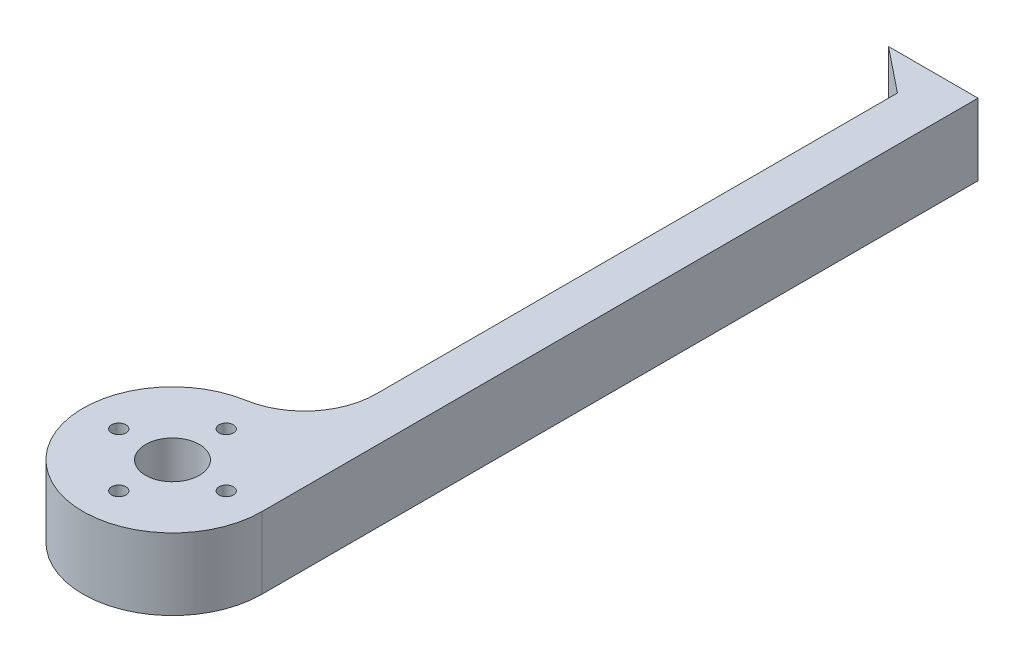
ISO-10303-21;
HEADER;
FILE_DESCRIPTION(('STEP AP214'),'2;1');
FILE_NAME('part.step','',(''),(''),'','','');
FILE_SCHEMA(('AUTOMOTIVE_DESIGN { 1 0 10303 214 1 1 1 1 }'));
ENDSEC;
DATA;
#1=APPLICATION_CONTEXT('core data for automotive mechanical design processes');
#2=APPLICATION_PROTOCOL_DEFINITION('international standard','automotive_design',2000,#1);
#3=PRODUCT_CONTEXT('',#1,'mechanical');
#4=PRODUCT('Part','Part','',(#3));
#5=PRODUCT_RELATED_PRODUCT_CATEGORY('part','',(#4));
#6=PRODUCT_DEFINITION_FORMATION('','',#4);
#7=PRODUCT_DEFINITION_CONTEXT('part definition',#1,'design');
#8=PRODUCT_DEFINITION('design','',#6,#7);
#9=PRODUCT_DEFINITION_SHAPE('','',#8);
#10=(LENGTH_UNIT() NAMED_UNIT(*) SI_UNIT(.MILLI.,.METRE.));
#11=(NAMED_UNIT(*) PLANE_ANGLE_UNIT() SI_UNIT($,.RADIAN.));
#12=(NAMED_UNIT(*) SI_UNIT($,.STERADIAN.) SOLID_ANGLE_UNIT());
#13=UNCERTAINTY_MEASURE_WITH_UNIT(LENGTH_MEASURE(1.E-05),#10,'distance_accuracy_value','');
#14=(GEOMETRIC_REPRESENTATION_CONTEXT(3) GLOBAL_UNCERTAINTY_ASSIGNED_CONTEXT((#13)) GLOBAL_UNIT_ASSIGNED_CONTEXT((#10,
#11,#12)) REPRESENTATION_CONTEXT('',''));
#15=CARTESIAN_POINT('',(0.,0.,0.));
#16=DIRECTION('',(0.,0.,1.));
#17=DIRECTION('',(1.,0.,0.));
#18=AXIS2_PLACEMENT_3D('',#15,#16,#17);
#19=CARTESIAN_POINT('',(0.,10.,0.));
#20=DIRECTION('',(0.,-1.,0.));
#21=DIRECTION('',(0.,0.,-1.));
#22=AXIS2_PLACEMENT_3D('',#19,#20,#21);
#23=CYLINDRICAL_SURFACE('',#22,12.5);
#24=CARTESIAN_POINT('',(0.,10.,0.));
#25=DIRECTION('',(0.,1.,0.));
#26=DIRECTION('',(0.,0.,1.));
#27=AXIS2_PLACEMENT_3D('',#24,#25,#26);
#28=CIRCLE('',#27,12.5);
#29=CARTESIAN_POINT('',(-2.08333333333334,10.,-12.3251662147909));
#30=VERTEX_POINT('',#29);
#31=CARTESIAN_POINT('',(12.5,10.,0.));
#32=VERTEX_POINT('',#31);
#33=EDGE_CURVE('E88',#30,#32,#28,.T.);
#34=ORIENTED_EDGE('',*,*,#33,.F.);
#35=DIRECTION('',(0.,-1.,0.));
#36=VECTOR('',#35,1.);
#37=CARTESIAN_POINT('',(-2.08333333333334,10.,-12.3251662147909));
#38=LINE('',#37,#36);
#39=CARTESIAN_POINT('',(-2.08333333333334,0.,-12.3251662147909));
#40=VERTEX_POINT('',#39);
#41=EDGE_CURVE('E108',#30,#40,#38,.T.);
#42=ORIENTED_EDGE('',*,*,#41,.T.);
#43=CARTESIAN_POINT('',(0.,0.,0.));
#44=DIRECTION('',(0.,1.,0.));
#45=DIRECTION('',(0.,0.,1.));
#46=AXIS2_PLACEMENT_3D('',#43,#44,#45);
#47=CIRCLE('',#46,12.5);
#48=CARTESIAN_POINT('',(12.5,0.,0.));
#49=VERTEX_POINT('',#48);
#50=EDGE_CURVE('E104',#40,#49,#47,.T.);
#51=ORIENTED_EDGE('',*,*,#50,.T.);
#52=DIRECTION('',(0.,-1.,0.));
#53=VECTOR('',#52,1.);
#54=CARTESIAN_POINT('',(12.5,10.,0.));
#55=LINE('',#54,#53);
#56=EDGE_CURVE('E103',#32,#49,#55,.T.);
#57=ORIENTED_EDGE('',*,*,#56,.F.);
#58=EDGE_LOOP('',(#34,#42,#51,#57));
#59=FACE_BOUND('',#58,.T.);
#60=ADVANCED_FACE('F35',(#59),#23,.T.);
#61=CARTESIAN_POINT('',(12.5,10.,0.));
#62=DIRECTION('',(1.,0.,0.));
#63=DIRECTION('',(0.,0.,-1.));
#64=AXIS2_PLACEMENT_3D('',#61,#62,#63);
#65=PLANE('',#64);
#66=DIRECTION('',(0.,0.,1.));
#67=VECTOR('',#66,1.);
#68=CARTESIAN_POINT('',(12.5,0.,0.));
#69=LINE('',#68,#67);
#70=CARTESIAN_POINT('',(12.5,0.,-100.));
#71=VERTEX_POINT('',#70);
#72=EDGE_CURVE('E139',#71,#49,#69,.T.);
#73=ORIENTED_EDGE('',*,*,#72,.F.);
#74=DIRECTION('',(0.,-1.,0.));
#75=VECTOR('',#74,1.);
#76=CARTESIAN_POINT('',(12.5,10.,-100.));
#77=LINE('',#76,#75);
#78=CARTESIAN_POINT('',(12.5,10.,-100.));
#79=VERTEX_POINT('',#78);
#80=EDGE_CURVE('E109',#79,#71,#77,.T.);
#81=ORIENTED_EDGE('',*,*,#80,.F.);
#82=DIRECTION('',(0.,0.,1.));
#83=VECTOR('',#82,1.);
#84=CARTESIAN_POINT('',(12.5,10.,0.));
#85=LINE('',#84,#83);
#86=EDGE_CURVE('E94',#79,#32,#85,.T.);
#87=ORIENTED_EDGE('',*,*,#86,.T.);
#88=ORIENTED_EDGE('',*,*,#56,.T.);
#89=EDGE_LOOP('',(#73,#81,#87,#88));
#90=FACE_BOUND('',#89,.T.);
#91=ADVANCED_FACE('F111',(#90),#65,.T.);
#92=CARTESIAN_POINT('',(0.,10.,-100.));
#93=DIRECTION('',(0.,0.,-1.));
#94=DIRECTION('',(-1.,0.,0.));
#95=AXIS2_PLACEMENT_3D('',#92,#93,#94);
#96=PLANE('',#95);
#97=DIRECTION('',(1.,0.,0.));
#98=VECTOR('',#97,1.);
#99=CARTESIAN_POINT('',(0.,0.,-100.));
#100=LINE('',#99,#98);
#101=CARTESIAN_POINT('',(0.,0.,-100.));
#102=VERTEX_POINT('',#101);
#103=EDGE_CURVE('E141',#102,#71,#100,.T.);
#104=ORIENTED_EDGE('',*,*,#103,.F.);
#105=DIRECTION('',(0.,-1.,0.));
#106=VECTOR('',#105,1.);
#107=CARTESIAN_POINT('',(0.,10.,-100.));
#108=LINE('',#107,#106);
#109=CARTESIAN_POINT('',(0.,10.,-100.));
#110=VERTEX_POINT('',#109);
#111=EDGE_CURVE('E160',#110,#102,#108,.T.);
#112=ORIENTED_EDGE('',*,*,#111,.F.);
#113=DIRECTION('',(1.,0.,0.));
#114=VECTOR('',#113,1.);
#115=CARTESIAN_POINT('',(0.,10.,-100.));
#116=LINE('',#115,#114);
#117=EDGE_CURVE('E112',#110,#79,#116,.T.);
#118=ORIENTED_EDGE('',*,*,#117,.T.);
#119=ORIENTED_EDGE('',*,*,#80,.T.);
#120=EDGE_LOOP('',(#104,#112,#118,#119));
#121=FACE_BOUND('',#120,.T.);
#122=ADVANCED_FACE('F170',(#121),#96,.T.);
#123=CARTESIAN_POINT('',(48.7804878048781,10.,-60.9756097560974));
#124=DIRECTION('',(-0.624695047554425,0.,0.780868809443029));
#125=DIRECTION('',(0.780868809443029,0.,0.624695047554425));
#126=AXIS2_PLACEMENT_3D('',#123,#124,#125);
#127=PLANE('',#126);
#128=DIRECTION('',(-0.780868809443029,0.,-0.624695047554425));
#129=VECTOR('',#128,1.);
#130=CARTESIAN_POINT('',(48.7804878048781,0.,-60.9756097560974));
#131=LINE('',#130,#129);
#132=CARTESIAN_POINT('',(6.24999999999998,0.,-95.));
#133=VERTEX_POINT('',#132);
#134=EDGE_CURVE('E144',#133,#102,#131,.T.);
#135=ORIENTED_EDGE('',*,*,#134,.F.);
#136=DIRECTION('',(0.,-1.,0.));
#137=VECTOR('',#136,1.);
#138=CARTESIAN_POINT('',(6.24999999999998,10.,-95.));
#139=LINE('',#138,#137);
#140=CARTESIAN_POINT('',(6.24999999999998,10.,-95.));
#141=VERTEX_POINT('',#140);
#142=EDGE_CURVE('E131',#141,#133,#139,.T.);
#143=ORIENTED_EDGE('',*,*,#142,.F.);
#144=DIRECTION('',(-0.780868809443029,0.,-0.624695047554425));
#145=VECTOR('',#144,1.);
#146=CARTESIAN_POINT('',(48.7804878048781,10.,-60.9756097560974));
#147=LINE('',#146,#145);
#148=EDGE_CURVE('E114',#141,#110,#147,.T.);
#149=ORIENTED_EDGE('',*,*,#148,.T.);
#150=ORIENTED_EDGE('',*,*,#111,.T.);
#151=EDGE_LOOP('',(#135,#143,#149,#150));
#152=FACE_BOUND('',#151,.T.);
#153=ADVANCED_FACE('F173',(#152),#127,.T.);
#154=CARTESIAN_POINT('',(-7.5,10.,0.));
#155=DIRECTION('',(0.,-1.,0.));
#156=DIRECTION('',(0.,0.,-1.));
#157=AXIS2_PLACEMENT_3D('',#154,#155,#156);
#158=CYLINDRICAL_SURFACE('',#157,1.);
#159=CARTESIAN_POINT('',(-7.5,10.,0.));
#160=DIRECTION('',(0.,1.,0.));
#161=DIRECTION('',(0.,0.,1.));
#162=AXIS2_PLACEMENT_3D('',#159,#160,#161);
#163=CIRCLE('',#162,1.);
#164=CARTESIAN_POINT('',(-7.5,10.,0.99999999999991));
#165=VERTEX_POINT('',#164);
#166=EDGE_CURVE('E125',#165,#165,#163,.T.);
#167=ORIENTED_EDGE('',*,*,#166,.T.);
#168=EDGE_LOOP('',(#167));
#169=FACE_BOUND('',#168,.T.);
#170=CARTESIAN_POINT('',(-7.5,0.,0.));
#171=DIRECTION('',(0.,1.,0.));
#172=DIRECTION('',(0.,0.,1.));
#173=AXIS2_PLACEMENT_3D('',#170,#171,#172);
#174=CIRCLE('',#173,1.);
#175=CARTESIAN_POINT('',(-7.5,0.,0.99999999999991));
#176=VERTEX_POINT('',#175);
#177=EDGE_CURVE('E152',#176,#176,#174,.T.);
#178=ORIENTED_EDGE('',*,*,#177,.F.);
#179=EDGE_LOOP('',(#178));
#180=FACE_BOUND('',#179,.T.);
#181=ADVANCED_FACE('F218',(#169,#180),#158,.F.);
#182=CARTESIAN_POINT('',(7.5,10.,0.));
#183=DIRECTION('',(0.,-1.,0.));
#184=DIRECTION('',(0.,0.,-1.));
#185=AXIS2_PLACEMENT_3D('',#182,#183,#184);
#186=CYLINDRICAL_SURFACE('',#185,1.);
#187=CARTESIAN_POINT('',(7.5,10.,0.));
#188=DIRECTION('',(0.,1.,0.));
#189=DIRECTION('',(0.,0.,1.));
#190=AXIS2_PLACEMENT_3D('',#187,#188,#189);
#191=CIRCLE('',#190,1.);
#192=CARTESIAN_POINT('',(7.5,10.,1.00000000000004));
#193=VERTEX_POINT('',#192);
#194=EDGE_CURVE('E122',#193,#193,#191,.T.);
#195=ORIENTED_EDGE('',*,*,#194,.T.);
#196=EDGE_LOOP('',(#195));
#197=FACE_BOUND('',#196,.T.);
#198=CARTESIAN_POINT('',(7.5,0.,0.));
#199=DIRECTION('',(0.,1.,0.));
#200=DIRECTION('',(0.,0.,1.));
#201=AXIS2_PLACEMENT_3D('',#198,#199,#200);
#202=CIRCLE('',#201,1.);
#203=CARTESIAN_POINT('',(7.5,0.,1.00000000000004));
#204=VERTEX_POINT('',#203);
#205=EDGE_CURVE('E149',#204,#204,#202,.T.);
#206=ORIENTED_EDGE('',*,*,#205,.F.);
#207=EDGE_LOOP('',(#206));
#208=FACE_BOUND('',#207,.T.);
#209=ADVANCED_FACE('F221',(#197,#208),#186,.F.);
#210=CARTESIAN_POINT('',(6.25,10.,0.));
#211=DIRECTION('',(1.,0.,0.));
#212=DIRECTION('',(0.,0.,-1.));
#213=AXIS2_PLACEMENT_3D('',#210,#211,#212);
#214=PLANE('',#213);
#215=DIRECTION('',(0.,0.,1.));
#216=VECTOR('',#215,1.);
#217=CARTESIAN_POINT('',(6.25,0.,0.));
#218=LINE('',#217,#216);
#219=CARTESIAN_POINT('',(6.25,0.,-22.1852991866236));
#220=VERTEX_POINT('',#219);
#221=EDGE_CURVE('E147',#133,#220,#218,.T.);
#222=ORIENTED_EDGE('',*,*,#221,.T.);
#223=DIRECTION('',(0.,1.,0.));
#224=VECTOR('',#223,1.);
#225=CARTESIAN_POINT('',(6.25,10.,-22.1852991866236));
#226=LINE('',#225,#224);
#227=CARTESIAN_POINT('',(6.25,10.,-22.1852991866236));
#228=VERTEX_POINT('',#227);
#229=EDGE_CURVE('E50',#220,#228,#226,.T.);
#230=ORIENTED_EDGE('',*,*,#229,.T.);
#231=DIRECTION('',(0.,0.,1.));
#232=VECTOR('',#231,1.);
#233=CARTESIAN_POINT('',(6.25,10.,0.));
#234=LINE('',#233,#232);
#235=EDGE_CURVE('E120',#141,#228,#234,.T.);
#236=ORIENTED_EDGE('',*,*,#235,.F.);
#237=ORIENTED_EDGE('',*,*,#142,.T.);
#238=EDGE_LOOP('',(#222,#230,#236,#237));
#239=FACE_BOUND('',#238,.T.);
#240=ADVANCED_FACE('F174',(#239),#214,.F.);
#241=CARTESIAN_POINT('',(0.,10.,-7.5));
#242=DIRECTION('',(0.,-1.,0.));
#243=DIRECTION('',(0.,0.,-1.));
#244=AXIS2_PLACEMENT_3D('',#241,#242,#243);
#245=CYLINDRICAL_SURFACE('',#244,1.);
#246=CARTESIAN_POINT('',(0.,10.,-7.5));
#247=DIRECTION('',(0.,1.,0.));
#248=DIRECTION('',(0.,0.,1.));
#249=AXIS2_PLACEMENT_3D('',#246,#247,#248);
#250=CIRCLE('',#249,1.);
#251=CARTESIAN_POINT('',(0.,10.,-6.5));
#252=VERTEX_POINT('',#251);
#253=EDGE_CURVE('E100',#252,#252,#250,.T.);
#254=ORIENTED_EDGE('',*,*,#253,.T.);
#255=EDGE_LOOP('',(#254));
#256=FACE_BOUND('',#255,.T.);
#257=CARTESIAN_POINT('',(0.,0.,-7.5));
#258=DIRECTION('',(0.,1.,0.));
#259=DIRECTION('',(0.,0.,1.));
#260=AXIS2_PLACEMENT_3D('',#257,#258,#259);
#261=CIRCLE('',#260,1.);
#262=CARTESIAN_POINT('',(0.,0.,-6.5));
#263=VERTEX_POINT('',#262);
#264=EDGE_CURVE('E135',#263,#263,#261,.T.);
#265=ORIENTED_EDGE('',*,*,#264,.F.);
#266=EDGE_LOOP('',(#265));
#267=FACE_BOUND('',#266,.T.);
#268=ADVANCED_FACE('F189',(#256,#267),#245,.F.);
#269=CARTESIAN_POINT('',(0.,10.,0.));
#270=DIRECTION('',(0.,-1.,0.));
#271=DIRECTION('',(0.,0.,-1.));
#272=AXIS2_PLACEMENT_3D('',#269,#270,#271);
#273=CYLINDRICAL_SURFACE('',#272,3.75);
#274=CARTESIAN_POINT('',(0.,10.,0.));
#275=DIRECTION('',(0.,1.,0.));
#276=DIRECTION('',(0.,0.,1.));
#277=AXIS2_PLACEMENT_3D('',#274,#275,#276);
#278=CIRCLE('',#277,3.75);
#279=CARTESIAN_POINT('',(0.,10.,3.75));
#280=VERTEX_POINT('',#279);
#281=EDGE_CURVE('E158',#280,#280,#278,.T.);
#282=ORIENTED_EDGE('',*,*,#281,.T.);
#283=EDGE_LOOP('',(#282));
#284=FACE_BOUND('',#283,.T.);
#285=CARTESIAN_POINT('',(0.,0.,0.));
#286=DIRECTION('',(0.,1.,0.));
#287=DIRECTION('',(0.,0.,1.));
#288=AXIS2_PLACEMENT_3D('',#285,#286,#287);
#289=CIRCLE('',#288,3.75);
#290=CARTESIAN_POINT('',(0.,0.,3.75));
#291=VERTEX_POINT('',#290);
#292=EDGE_CURVE('E132',#291,#291,#289,.T.);
#293=ORIENTED_EDGE('',*,*,#292,.F.);
#294=EDGE_LOOP('',(#293));
#295=FACE_BOUND('',#294,.T.);
#296=ADVANCED_FACE('F191',(#284,#295),#273,.F.);
#297=CARTESIAN_POINT('',(0.,10.,7.5));
#298=DIRECTION('',(0.,-1.,0.));
#299=DIRECTION('',(0.,0.,-1.));
#300=AXIS2_PLACEMENT_3D('',#297,#298,#299);
#301=CYLINDRICAL_SURFACE('',#300,1.);
#302=CARTESIAN_POINT('',(0.,10.,7.5));
#303=DIRECTION('',(0.,1.,0.));
#304=DIRECTION('',(0.,0.,1.));
#305=AXIS2_PLACEMENT_3D('',#302,#303,#304);
#306=CIRCLE('',#305,1.);
#307=CARTESIAN_POINT('',(0.,10.,8.5));
#308=VERTEX_POINT('',#307);
#309=EDGE_CURVE('E128',#308,#308,#306,.T.);
#310=ORIENTED_EDGE('',*,*,#309,.T.);
#311=EDGE_LOOP('',(#310));
#312=FACE_BOUND('',#311,.T.);
#313=CARTESIAN_POINT('',(0.,0.,7.5));
#314=DIRECTION('',(0.,1.,0.));
#315=DIRECTION('',(0.,0.,1.));
#316=AXIS2_PLACEMENT_3D('',#313,#314,#315);
#317=CIRCLE('',#316,1.);
#318=CARTESIAN_POINT('',(0.,0.,8.5));
#319=VERTEX_POINT('',#318);
#320=EDGE_CURVE('E155',#319,#319,#317,.T.);
#321=ORIENTED_EDGE('',*,*,#320,.F.);
#322=EDGE_LOOP('',(#321));
#323=FACE_BOUND('',#322,.T.);
#324=ADVANCED_FACE('F194',(#312,#323),#301,.F.);
#325=CARTESIAN_POINT('',(0.,10.,0.));
#326=DIRECTION('',(0.,1.,0.));
#327=DIRECTION('',(0.,0.,1.));
#328=AXIS2_PLACEMENT_3D('',#325,#326,#327);
#329=PLANE('',#328);
#330=ORIENTED_EDGE('',*,*,#281,.F.);
#331=EDGE_LOOP('',(#330));
#332=FACE_BOUND('',#331,.T.);
#333=ORIENTED_EDGE('',*,*,#253,.F.);
#334=EDGE_LOOP('',(#333));
#335=FACE_BOUND('',#334,.T.);
#336=ORIENTED_EDGE('',*,*,#235,.T.);
#337=CARTESIAN_POINT('',(-3.75,10.,-22.1852991866236));
#338=DIRECTION('',(0.,1.,0.));
#339=DIRECTION('',(0.,0.,1.));
#340=AXIS2_PLACEMENT_3D('',#337,#338,#339);
#341=CIRCLE('',#340,10.);
#342=EDGE_CURVE('E11',#228,#30,#341,.F.);
#343=ORIENTED_EDGE('',*,*,#342,.T.);
#344=ORIENTED_EDGE('',*,*,#33,.T.);
#345=ORIENTED_EDGE('',*,*,#86,.F.);
#346=ORIENTED_EDGE('',*,*,#117,.F.);
#347=ORIENTED_EDGE('',*,*,#148,.F.);
#348=EDGE_LOOP('',(#336,#343,#344,#345,#346,#347));
#349=FACE_BOUND('',#348,.T.);
#350=ORIENTED_EDGE('',*,*,#194,.F.);
#351=EDGE_LOOP('',(#350));
#352=FACE_BOUND('',#351,.T.);
#353=ORIENTED_EDGE('',*,*,#166,.F.);
#354=EDGE_LOOP('',(#353));
#355=FACE_BOUND('',#354,.T.);
#356=ORIENTED_EDGE('',*,*,#309,.F.);
#357=EDGE_LOOP('',(#356));
#358=FACE_BOUND('',#357,.T.);
#359=ADVANCED_FACE('F90',(#332,#335,#349,#352,#355,#358),#329,.T.);
#360=CARTESIAN_POINT('',(0.,0.,0.));
#361=DIRECTION('',(0.,1.,0.));
#362=DIRECTION('',(0.,0.,1.));
#363=AXIS2_PLACEMENT_3D('',#360,#361,#362);
#364=PLANE('',#363);
#365=ORIENTED_EDGE('',*,*,#292,.T.);
#366=EDGE_LOOP('',(#365));
#367=FACE_BOUND('',#366,.T.);
#368=ORIENTED_EDGE('',*,*,#264,.T.);
#369=EDGE_LOOP('',(#368));
#370=FACE_BOUND('',#369,.T.);
#371=ORIENTED_EDGE('',*,*,#50,.F.);
#372=CARTESIAN_POINT('',(-3.75,0.,-22.1852991866236));
#373=DIRECTION('',(0.,1.,0.));
#374=DIRECTION('',(0.,0.,1.));
#375=AXIS2_PLACEMENT_3D('',#372,#373,#374);
#376=CIRCLE('',#375,10.);
#377=EDGE_CURVE('E43',#40,#220,#376,.T.);
#378=ORIENTED_EDGE('',*,*,#377,.T.);
#379=ORIENTED_EDGE('',*,*,#221,.F.);
#380=ORIENTED_EDGE('',*,*,#134,.T.);
#381=ORIENTED_EDGE('',*,*,#103,.T.);
#382=ORIENTED_EDGE('',*,*,#72,.T.);
#383=EDGE_LOOP('',(#371,#378,#379,#380,#381,#382));
#384=FACE_BOUND('',#383,.T.);
#385=ORIENTED_EDGE('',*,*,#205,.T.);
#386=EDGE_LOOP('',(#385));
#387=FACE_BOUND('',#386,.T.);
#388=ORIENTED_EDGE('',*,*,#177,.T.);
#389=EDGE_LOOP('',(#388));
#390=FACE_BOUND('',#389,.T.);
#391=ORIENTED_EDGE('',*,*,#320,.T.);
#392=EDGE_LOOP('',(#391));
#393=FACE_BOUND('',#392,.T.);
#394=ADVANCED_FACE('F165',(#367,#370,#384,#387,#390,#393),#364,.F.);
#395=CARTESIAN_POINT('',(-3.75,10.,-22.1852991866236));
#396=DIRECTION('',(0.,-1.,0.));
#397=DIRECTION('',(0.,0.,-1.));
#398=AXIS2_PLACEMENT_3D('',#395,#396,#397);
#399=CYLINDRICAL_SURFACE('',#398,10.);
#400=ORIENTED_EDGE('',*,*,#342,.F.);
#401=ORIENTED_EDGE('',*,*,#229,.F.);
#402=ORIENTED_EDGE('',*,*,#377,.F.);
#403=ORIENTED_EDGE('',*,*,#41,.F.);
#404=EDGE_LOOP('',(#400,#401,#402,#403));
#405=FACE_BOUND('',#404,.T.);
#406=ADVANCED_FACE('F37',(#405),#399,.F.);
#407=CLOSED_SHELL('',(#60,#91,#122,#153,#181,#209,#240,#268,#296,#324,#359,#394,#406));
#408=MANIFOLD_SOLID_BREP('B2',#407);
#409=ADVANCED_BREP_SHAPE_REPRESENTATION('',(#18,#408),#14);
#410=SHAPE_DEFINITION_REPRESENTATION(#9,#409);
ENDSEC;
END-ISO-10303-21;
